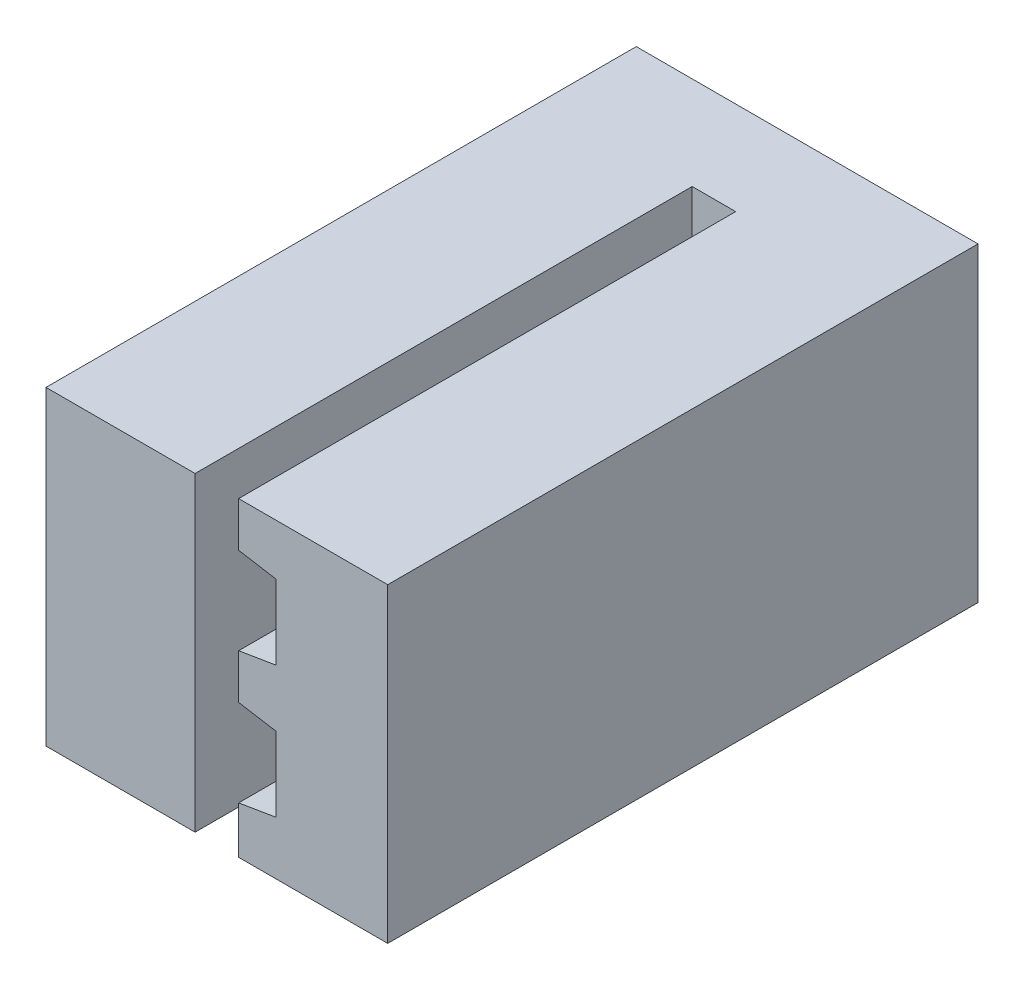
ISO-10303-21;
HEADER;
FILE_DESCRIPTION(('STEP AP214'),'2;1');
FILE_NAME('part.step','',(''),(''),'','','');
FILE_SCHEMA(('AUTOMOTIVE_DESIGN { 1 0 10303 214 1 1 1 1 }'));
ENDSEC;
DATA;
#1=APPLICATION_CONTEXT('core data for automotive mechanical design processes');
#2=APPLICATION_PROTOCOL_DEFINITION('international standard','automotive_design',2000,#1);
#3=PRODUCT_CONTEXT('',#1,'mechanical');
#4=PRODUCT('Part','Part','',(#3));
#5=PRODUCT_RELATED_PRODUCT_CATEGORY('part','',(#4));
#6=PRODUCT_DEFINITION_FORMATION('','',#4);
#7=PRODUCT_DEFINITION_CONTEXT('part definition',#1,'design');
#8=PRODUCT_DEFINITION('design','',#6,#7);
#9=PRODUCT_DEFINITION_SHAPE('','',#8);
#10=(LENGTH_UNIT() NAMED_UNIT(*) SI_UNIT(.MILLI.,.METRE.));
#11=(NAMED_UNIT(*) PLANE_ANGLE_UNIT() SI_UNIT($,.RADIAN.));
#12=(NAMED_UNIT(*) SI_UNIT($,.STERADIAN.) SOLID_ANGLE_UNIT());
#13=UNCERTAINTY_MEASURE_WITH_UNIT(LENGTH_MEASURE(1.E-05),#10,'distance_accuracy_value','');
#14=(GEOMETRIC_REPRESENTATION_CONTEXT(3) GLOBAL_UNCERTAINTY_ASSIGNED_CONTEXT((#13)) GLOBAL_UNIT_ASSIGNED_CONTEXT((#10,
#11,#12)) REPRESENTATION_CONTEXT('',''));
#15=CARTESIAN_POINT('',(0.,0.,0.));
#16=DIRECTION('',(0.,0.,1.));
#17=DIRECTION('',(1.,0.,0.));
#18=AXIS2_PLACEMENT_3D('',#15,#16,#17);
#19=CARTESIAN_POINT('',(0.,0.,0.));
#20=DIRECTION('',(0.,0.,-1.));
#21=DIRECTION('',(-1.,0.,0.));
#22=AXIS2_PLACEMENT_3D('',#19,#20,#21);
#23=PLANE('',#22);
#24=DIRECTION('',(0.,-1.,0.));
#25=VECTOR('',#24,1.);
#26=CARTESIAN_POINT('',(0.,5.,0.));
#27=LINE('',#26,#25);
#28=CARTESIAN_POINT('',(0.,5.,0.));
#29=VERTEX_POINT('',#28);
#30=CARTESIAN_POINT('',(0.,4.27942676809432,0.));
#31=VERTEX_POINT('',#30);
#32=EDGE_CURVE('E136',#29,#31,#27,.T.);
#33=ORIENTED_EDGE('',*,*,#32,.F.);
#34=DIRECTION('',(-1.,0.,0.));
#35=VECTOR('',#34,1.);
#36=CARTESIAN_POINT('',(0.,5.,0.));
#37=LINE('',#36,#35);
#38=CARTESIAN_POINT('',(-0.7,5.,0.));
#39=VERTEX_POINT('',#38);
#40=EDGE_CURVE('E254',#29,#39,#37,.T.);
#41=ORIENTED_EDGE('',*,*,#40,.T.);
#42=DIRECTION('',(0.,1.,0.));
#43=VECTOR('',#42,1.);
#44=CARTESIAN_POINT('',(-0.7,7.15885354,0.));
#45=LINE('',#44,#43);
#46=CARTESIAN_POINT('',(-0.699999999999999,0.,0.));
#47=VERTEX_POINT('',#46);
#48=EDGE_CURVE('E250',#47,#39,#45,.T.);
#49=ORIENTED_EDGE('',*,*,#48,.F.);
#50=DIRECTION('',(-1.,0.,0.));
#51=VECTOR('',#50,1.);
#52=CARTESIAN_POINT('',(2.4,0.,0.));
#53=LINE('',#52,#51);
#54=CARTESIAN_POINT('',(0.,0.,0.));
#55=VERTEX_POINT('',#54);
#56=EDGE_CURVE('E232',#55,#47,#53,.T.);
#57=ORIENTED_EDGE('',*,*,#56,.F.);
#58=DIRECTION('',(0.,-1.,0.));
#59=VECTOR('',#58,1.);
#60=CARTESIAN_POINT('',(0.,0.758853536188495,0.));
#61=LINE('',#60,#59);
#62=CARTESIAN_POINT('',(0.,0.758853536188495,0.));
#63=VERTEX_POINT('',#62);
#64=EDGE_CURVE('E82',#63,#55,#61,.T.);
#65=ORIENTED_EDGE('',*,*,#64,.F.);
#66=DIRECTION('',(-0.986393923832117,-0.164398987305518,0.));
#67=VECTOR('',#66,1.);
#68=CARTESIAN_POINT('',(0.599999999999998,0.858853536188595,0.));
#69=LINE('',#68,#67);
#70=CARTESIAN_POINT('',(0.599999999999998,0.858853536188595,0.));
#71=VERTEX_POINT('',#70);
#72=EDGE_CURVE('E122',#71,#63,#69,.T.);
#73=ORIENTED_EDGE('',*,*,#72,.F.);
#74=DIRECTION('',(0.,-1.,0.));
#75=VECTOR('',#74,1.);
#76=CARTESIAN_POINT('',(0.599999999999998,2.05885353618846,0.));
#77=LINE('',#76,#75);
#78=CARTESIAN_POINT('',(0.599999999999998,2.05885353618846,0.));
#79=VERTEX_POINT('',#78);
#80=EDGE_CURVE('E152',#79,#71,#77,.T.);
#81=ORIENTED_EDGE('',*,*,#80,.F.);
#82=DIRECTION('',(0.986393923832117,-0.164398987305517,0.));
#83=VECTOR('',#82,1.);
#84=CARTESIAN_POINT('',(0.,2.15885353618856,0.));
#85=LINE('',#84,#83);
#86=CARTESIAN_POINT('',(0.,2.15885353618856,0.));
#87=VERTEX_POINT('',#86);
#88=EDGE_CURVE('E149',#87,#79,#85,.T.);
#89=ORIENTED_EDGE('',*,*,#88,.F.);
#90=DIRECTION('',(0.,-1.,0.));
#91=VECTOR('',#90,1.);
#92=CARTESIAN_POINT('',(0.,2.87942676809425,0.));
#93=LINE('',#92,#91);
#94=CARTESIAN_POINT('',(0.,2.87942676809425,0.));
#95=VERTEX_POINT('',#94);
#96=EDGE_CURVE('E146',#95,#87,#93,.T.);
#97=ORIENTED_EDGE('',*,*,#96,.F.);
#98=DIRECTION('',(-0.986393923832117,-0.164398987305518,0.));
#99=VECTOR('',#98,1.);
#100=CARTESIAN_POINT('',(0.599999999999998,2.97942676809435,0.));
#101=LINE('',#100,#99);
#102=CARTESIAN_POINT('',(0.599999999999998,2.97942676809435,0.));
#103=VERTEX_POINT('',#102);
#104=EDGE_CURVE('E143',#103,#95,#101,.T.);
#105=ORIENTED_EDGE('',*,*,#104,.F.);
#106=DIRECTION('',(0.,-1.,0.));
#107=VECTOR('',#106,1.);
#108=CARTESIAN_POINT('',(0.599999999999998,4.17942676809422,0.));
#109=LINE('',#108,#107);
#110=CARTESIAN_POINT('',(0.599999999999998,4.17942676809422,0.));
#111=VERTEX_POINT('',#110);
#112=EDGE_CURVE('E71',#111,#103,#109,.T.);
#113=ORIENTED_EDGE('',*,*,#112,.F.);
#114=DIRECTION('',(0.986393923832117,-0.164398987305519,0.));
#115=VECTOR('',#114,1.);
#116=CARTESIAN_POINT('',(0.,4.27942676809432,0.));
#117=LINE('',#116,#115);
#118=EDGE_CURVE('E139',#31,#111,#117,.T.);
#119=ORIENTED_EDGE('',*,*,#118,.F.);
#120=EDGE_LOOP('',(#33,#41,#49,#57,#65,#73,#81,#89,#97,#105,#113,#119));
#121=FACE_BOUND('',#120,.T.);
#122=ADVANCED_FACE('F32',(#121),#23,.F.);
#123=CARTESIAN_POINT('',(0.,5.,8.));
#124=DIRECTION('',(1.,0.,0.));
#125=DIRECTION('',(0.,1.,0.));
#126=AXIS2_PLACEMENT_3D('',#123,#124,#125);
#127=PLANE('',#126);
#128=ORIENTED_EDGE('',*,*,#32,.T.);
#129=DIRECTION('',(0.,0.,-1.));
#130=VECTOR('',#129,1.);
#131=CARTESIAN_POINT('',(0.,4.27942676809432,8.));
#132=LINE('',#131,#130);
#133=CARTESIAN_POINT('',(0.,4.27942676809432,8.));
#134=VERTEX_POINT('',#133);
#135=EDGE_CURVE('E11',#134,#31,#132,.T.);
#136=ORIENTED_EDGE('',*,*,#135,.F.);
#137=DIRECTION('',(0.,-1.,0.));
#138=VECTOR('',#137,1.);
#139=CARTESIAN_POINT('',(0.,5.,8.));
#140=LINE('',#139,#138);
#141=CARTESIAN_POINT('',(0.,5.,8.));
#142=VERTEX_POINT('',#141);
#143=EDGE_CURVE('E160',#142,#134,#140,.T.);
#144=ORIENTED_EDGE('',*,*,#143,.F.);
#145=DIRECTION('',(0.,0.,-1.));
#146=VECTOR('',#145,1.);
#147=CARTESIAN_POINT('',(0.,5.,8.));
#148=LINE('',#147,#146);
#149=EDGE_CURVE('E135',#142,#29,#148,.T.);
#150=ORIENTED_EDGE('',*,*,#149,.T.);
#151=EDGE_LOOP('',(#128,#136,#144,#150));
#152=FACE_BOUND('',#151,.T.);
#153=ADVANCED_FACE('F34',(#152),#127,.F.);
#154=CARTESIAN_POINT('',(0.,4.27942676809432,8.));
#155=DIRECTION('',(0.164398987305519,0.986393923832117,0.));
#156=DIRECTION('',(-0.986393923832117,0.164398987305519,0.));
#157=AXIS2_PLACEMENT_3D('',#154,#155,#156);
#158=PLANE('',#157);
#159=ORIENTED_EDGE('',*,*,#118,.T.);
#160=DIRECTION('',(0.,0.,-1.));
#161=VECTOR('',#160,1.);
#162=CARTESIAN_POINT('',(0.599999999999998,4.17942676809422,8.));
#163=LINE('',#162,#161);
#164=CARTESIAN_POINT('',(0.599999999999998,4.17942676809422,8.));
#165=VERTEX_POINT('',#164);
#166=EDGE_CURVE('E41',#165,#111,#163,.T.);
#167=ORIENTED_EDGE('',*,*,#166,.F.);
#168=DIRECTION('',(0.986393923832117,-0.164398987305519,0.));
#169=VECTOR('',#168,1.);
#170=CARTESIAN_POINT('',(0.,4.27942676809432,8.));
#171=LINE('',#170,#169);
#172=EDGE_CURVE('E196',#134,#165,#171,.T.);
#173=ORIENTED_EDGE('',*,*,#172,.F.);
#174=ORIENTED_EDGE('',*,*,#135,.T.);
#175=EDGE_LOOP('',(#159,#167,#173,#174));
#176=FACE_BOUND('',#175,.T.);
#177=ADVANCED_FACE('F195',(#176),#158,.F.);
#178=CARTESIAN_POINT('',(0.599999999999998,4.17942676809422,8.));
#179=DIRECTION('',(1.,0.,0.));
#180=DIRECTION('',(0.,1.,0.));
#181=AXIS2_PLACEMENT_3D('',#178,#179,#180);
#182=PLANE('',#181);
#183=ORIENTED_EDGE('',*,*,#112,.T.);
#184=DIRECTION('',(0.,0.,-1.));
#185=VECTOR('',#184,1.);
#186=CARTESIAN_POINT('',(0.599999999999998,2.97942676809435,8.));
#187=LINE('',#186,#185);
#188=CARTESIAN_POINT('',(0.599999999999998,2.97942676809435,8.));
#189=VERTEX_POINT('',#188);
#190=EDGE_CURVE('E184',#189,#103,#187,.T.);
#191=ORIENTED_EDGE('',*,*,#190,.F.);
#192=DIRECTION('',(0.,-1.,0.));
#193=VECTOR('',#192,1.);
#194=CARTESIAN_POINT('',(0.599999999999998,4.17942676809422,8.));
#195=LINE('',#194,#193);
#196=EDGE_CURVE('E193',#165,#189,#195,.T.);
#197=ORIENTED_EDGE('',*,*,#196,.F.);
#198=ORIENTED_EDGE('',*,*,#166,.T.);
#199=EDGE_LOOP('',(#183,#191,#197,#198));
#200=FACE_BOUND('',#199,.T.);
#201=ADVANCED_FACE('F190',(#200),#182,.F.);
#202=CARTESIAN_POINT('',(0.599999999999998,2.97942676809435,8.));
#203=DIRECTION('',(0.164398987305518,-0.986393923832117,0.));
#204=DIRECTION('',(0.986393923832117,0.164398987305518,0.));
#205=AXIS2_PLACEMENT_3D('',#202,#203,#204);
#206=PLANE('',#205);
#207=ORIENTED_EDGE('',*,*,#104,.T.);
#208=DIRECTION('',(0.,0.,-1.));
#209=VECTOR('',#208,1.);
#210=CARTESIAN_POINT('',(0.,2.87942676809425,8.));
#211=LINE('',#210,#209);
#212=CARTESIAN_POINT('',(0.,2.87942676809425,8.));
#213=VERTEX_POINT('',#212);
#214=EDGE_CURVE('E181',#213,#95,#211,.T.);
#215=ORIENTED_EDGE('',*,*,#214,.F.);
#216=DIRECTION('',(-0.986393923832117,-0.164398987305518,0.));
#217=VECTOR('',#216,1.);
#218=CARTESIAN_POINT('',(0.599999999999998,2.97942676809435,8.));
#219=LINE('',#218,#217);
#220=EDGE_CURVE('E227',#189,#213,#219,.T.);
#221=ORIENTED_EDGE('',*,*,#220,.F.);
#222=ORIENTED_EDGE('',*,*,#190,.T.);
#223=EDGE_LOOP('',(#207,#215,#221,#222));
#224=FACE_BOUND('',#223,.T.);
#225=ADVANCED_FACE('F355',(#224),#206,.F.);
#226=CARTESIAN_POINT('',(0.,2.87942676809425,8.));
#227=DIRECTION('',(1.,0.,0.));
#228=DIRECTION('',(0.,1.,0.));
#229=AXIS2_PLACEMENT_3D('',#226,#227,#228);
#230=PLANE('',#229);
#231=ORIENTED_EDGE('',*,*,#96,.T.);
#232=DIRECTION('',(0.,0.,-1.));
#233=VECTOR('',#232,1.);
#234=CARTESIAN_POINT('',(0.,2.15885353618856,8.));
#235=LINE('',#234,#233);
#236=CARTESIAN_POINT('',(0.,2.15885353618856,8.));
#237=VERTEX_POINT('',#236);
#238=EDGE_CURVE('E178',#237,#87,#235,.T.);
#239=ORIENTED_EDGE('',*,*,#238,.F.);
#240=DIRECTION('',(0.,-1.,0.));
#241=VECTOR('',#240,1.);
#242=CARTESIAN_POINT('',(0.,2.87942676809425,8.));
#243=LINE('',#242,#241);
#244=EDGE_CURVE('E223',#213,#237,#243,.T.);
#245=ORIENTED_EDGE('',*,*,#244,.F.);
#246=ORIENTED_EDGE('',*,*,#214,.T.);
#247=EDGE_LOOP('',(#231,#239,#245,#246));
#248=FACE_BOUND('',#247,.T.);
#249=ADVANCED_FACE('F352',(#248),#230,.F.);
#250=CARTESIAN_POINT('',(0.,2.15885353618856,8.));
#251=DIRECTION('',(0.164398987305517,0.986393923832117,0.));
#252=DIRECTION('',(-0.986393923832117,0.164398987305517,0.));
#253=AXIS2_PLACEMENT_3D('',#250,#251,#252);
#254=PLANE('',#253);
#255=ORIENTED_EDGE('',*,*,#88,.T.);
#256=DIRECTION('',(0.,0.,-1.));
#257=VECTOR('',#256,1.);
#258=CARTESIAN_POINT('',(0.599999999999998,2.05885353618846,8.));
#259=LINE('',#258,#257);
#260=CARTESIAN_POINT('',(0.599999999999998,2.05885353618846,8.));
#261=VERTEX_POINT('',#260);
#262=EDGE_CURVE('E175',#261,#79,#259,.T.);
#263=ORIENTED_EDGE('',*,*,#262,.F.);
#264=DIRECTION('',(0.986393923832117,-0.164398987305517,0.));
#265=VECTOR('',#264,1.);
#266=CARTESIAN_POINT('',(0.,2.15885353618856,8.));
#267=LINE('',#266,#265);
#268=EDGE_CURVE('E222',#237,#261,#267,.T.);
#269=ORIENTED_EDGE('',*,*,#268,.F.);
#270=ORIENTED_EDGE('',*,*,#238,.T.);
#271=EDGE_LOOP('',(#255,#263,#269,#270));
#272=FACE_BOUND('',#271,.T.);
#273=ADVANCED_FACE('F218',(#272),#254,.F.);
#274=CARTESIAN_POINT('',(0.599999999999998,2.05885353618846,8.));
#275=DIRECTION('',(1.,0.,0.));
#276=DIRECTION('',(0.,0.,-1.));
#277=AXIS2_PLACEMENT_3D('',#274,#275,#276);
#278=PLANE('',#277);
#279=ORIENTED_EDGE('',*,*,#80,.T.);
#280=DIRECTION('',(0.,0.,-1.));
#281=VECTOR('',#280,1.);
#282=CARTESIAN_POINT('',(0.599999999999998,0.858853536188595,8.));
#283=LINE('',#282,#281);
#284=CARTESIAN_POINT('',(0.599999999999998,0.858853536188595,8.));
#285=VERTEX_POINT('',#284);
#286=EDGE_CURVE('E124',#285,#71,#283,.T.);
#287=ORIENTED_EDGE('',*,*,#286,.F.);
#288=DIRECTION('',(0.,-1.,0.));
#289=VECTOR('',#288,1.);
#290=CARTESIAN_POINT('',(0.599999999999998,2.05885353618846,8.));
#291=LINE('',#290,#289);
#292=EDGE_CURVE('E114',#261,#285,#291,.T.);
#293=ORIENTED_EDGE('',*,*,#292,.F.);
#294=ORIENTED_EDGE('',*,*,#262,.T.);
#295=EDGE_LOOP('',(#279,#287,#293,#294));
#296=FACE_BOUND('',#295,.T.);
#297=ADVANCED_FACE('F221',(#296),#278,.F.);
#298=CARTESIAN_POINT('',(0.599999999999998,0.858853536188595,8.));
#299=DIRECTION('',(0.164398987305518,-0.986393923832117,0.));
#300=DIRECTION('',(0.986393923832117,0.164398987305518,0.));
#301=AXIS2_PLACEMENT_3D('',#298,#299,#300);
#302=PLANE('',#301);
#303=ORIENTED_EDGE('',*,*,#72,.T.);
#304=DIRECTION('',(0.,0.,-1.));
#305=VECTOR('',#304,1.);
#306=CARTESIAN_POINT('',(0.,0.758853536188495,8.));
#307=LINE('',#306,#305);
#308=CARTESIAN_POINT('',(0.,0.758853536188495,8.));
#309=VERTEX_POINT('',#308);
#310=EDGE_CURVE('E120',#309,#63,#307,.T.);
#311=ORIENTED_EDGE('',*,*,#310,.F.);
#312=DIRECTION('',(-0.986393923832117,-0.164398987305518,0.));
#313=VECTOR('',#312,1.);
#314=CARTESIAN_POINT('',(0.599999999999998,0.858853536188595,8.));
#315=LINE('',#314,#313);
#316=EDGE_CURVE('E106',#285,#309,#315,.T.);
#317=ORIENTED_EDGE('',*,*,#316,.F.);
#318=ORIENTED_EDGE('',*,*,#286,.T.);
#319=EDGE_LOOP('',(#303,#311,#317,#318));
#320=FACE_BOUND('',#319,.T.);
#321=ADVANCED_FACE('F121',(#320),#302,.F.);
#322=CARTESIAN_POINT('',(0.,0.758853536188495,8.));
#323=DIRECTION('',(1.,0.,0.));
#324=DIRECTION('',(0.,1.,0.));
#325=AXIS2_PLACEMENT_3D('',#322,#323,#324);
#326=PLANE('',#325);
#327=ORIENTED_EDGE('',*,*,#64,.T.);
#328=DIRECTION('',(0.,0.,-1.));
#329=VECTOR('',#328,1.);
#330=CARTESIAN_POINT('',(0.,0.,8.));
#331=LINE('',#330,#329);
#332=CARTESIAN_POINT('',(0.,0.,8.));
#333=VERTEX_POINT('',#332);
#334=EDGE_CURVE('E125',#333,#55,#331,.T.);
#335=ORIENTED_EDGE('',*,*,#334,.F.);
#336=DIRECTION('',(0.,-1.,0.));
#337=VECTOR('',#336,1.);
#338=CARTESIAN_POINT('',(0.,0.758853536188495,8.));
#339=LINE('',#338,#337);
#340=EDGE_CURVE('E111',#309,#333,#339,.T.);
#341=ORIENTED_EDGE('',*,*,#340,.F.);
#342=ORIENTED_EDGE('',*,*,#310,.T.);
#343=EDGE_LOOP('',(#327,#335,#341,#342));
#344=FACE_BOUND('',#343,.T.);
#345=ADVANCED_FACE('F127',(#344),#326,.F.);
#346=CARTESIAN_POINT('',(0.,0.,8.));
#347=DIRECTION('',(0.,1.,0.));
#348=DIRECTION('',(0.,0.,1.));
#349=AXIS2_PLACEMENT_3D('',#346,#347,#348);
#350=PLANE('',#349);
#351=ORIENTED_EDGE('',*,*,#334,.T.);
#352=ORIENTED_EDGE('',*,*,#56,.T.);
#353=DIRECTION('',(0.,0.,-1.));
#354=VECTOR('',#353,1.);
#355=CARTESIAN_POINT('',(-0.699999999999999,0.,8.));
#356=LINE('',#355,#354);
#357=CARTESIAN_POINT('',(-0.699999999999999,0.,8.));
#358=VERTEX_POINT('',#357);
#359=EDGE_CURVE('E236',#358,#47,#356,.T.);
#360=ORIENTED_EDGE('',*,*,#359,.F.);
#361=DIRECTION('',(1.,0.,0.));
#362=VECTOR('',#361,1.);
#363=CARTESIAN_POINT('',(-0.699999999999999,0.,8.));
#364=LINE('',#363,#362);
#365=CARTESIAN_POINT('',(-3.1,0.,8.));
#366=VERTEX_POINT('',#365);
#367=EDGE_CURVE('E249',#366,#358,#364,.T.);
#368=ORIENTED_EDGE('',*,*,#367,.F.);
#369=DIRECTION('',(0.,0.,1.));
#370=VECTOR('',#369,1.);
#371=CARTESIAN_POINT('',(-3.1,0.,-1.5));
#372=LINE('',#371,#370);
#373=CARTESIAN_POINT('',(-3.1,0.,-1.5));
#374=VERTEX_POINT('',#373);
#375=EDGE_CURVE('E140',#374,#366,#372,.T.);
#376=ORIENTED_EDGE('',*,*,#375,.F.);
#377=DIRECTION('',(-1.,0.,0.));
#378=VECTOR('',#377,1.);
#379=CARTESIAN_POINT('',(2.4,0.,-1.5));
#380=LINE('',#379,#378);
#381=CARTESIAN_POINT('',(2.4,0.,-1.5));
#382=VERTEX_POINT('',#381);
#383=EDGE_CURVE('E242',#382,#374,#380,.T.);
#384=ORIENTED_EDGE('',*,*,#383,.F.);
#385=DIRECTION('',(0.,0.,-1.));
#386=VECTOR('',#385,1.);
#387=CARTESIAN_POINT('',(2.4,0.,8.));
#388=LINE('',#387,#386);
#389=CARTESIAN_POINT('',(2.4,0.,8.));
#390=VERTEX_POINT('',#389);
#391=EDGE_CURVE('E162',#390,#382,#388,.T.);
#392=ORIENTED_EDGE('',*,*,#391,.F.);
#393=DIRECTION('',(1.,0.,0.));
#394=VECTOR('',#393,1.);
#395=CARTESIAN_POINT('',(0.,0.,8.));
#396=LINE('',#395,#394);
#397=EDGE_CURVE('E58',#333,#390,#396,.T.);
#398=ORIENTED_EDGE('',*,*,#397,.F.);
#399=EDGE_LOOP('',(#351,#352,#360,#368,#376,#384,#392,#398));
#400=FACE_BOUND('',#399,.T.);
#401=ADVANCED_FACE('F308',(#400),#350,.F.);
#402=CARTESIAN_POINT('',(2.4,0.,8.));
#403=DIRECTION('',(-1.,0.,0.));
#404=DIRECTION('',(0.,0.,1.));
#405=AXIS2_PLACEMENT_3D('',#402,#403,#404);
#406=PLANE('',#405);
#407=DIRECTION('',(0.,-1.,0.));
#408=VECTOR('',#407,1.);
#409=CARTESIAN_POINT('',(2.4,7.15885354,-1.5));
#410=LINE('',#409,#408);
#411=CARTESIAN_POINT('',(2.4,5.,-1.5));
#412=VERTEX_POINT('',#411);
#413=EDGE_CURVE('E235',#412,#382,#410,.T.);
#414=ORIENTED_EDGE('',*,*,#413,.F.);
#415=DIRECTION('',(0.,0.,1.));
#416=VECTOR('',#415,1.);
#417=CARTESIAN_POINT('',(2.4,5.,-1.5));
#418=LINE('',#417,#416);
#419=CARTESIAN_POINT('',(2.4,5.,8.));
#420=VERTEX_POINT('',#419);
#421=EDGE_CURVE('E266',#412,#420,#418,.T.);
#422=ORIENTED_EDGE('',*,*,#421,.T.);
#423=DIRECTION('',(0.,1.,0.));
#424=VECTOR('',#423,1.);
#425=CARTESIAN_POINT('',(2.4,0.,8.));
#426=LINE('',#425,#424);
#427=EDGE_CURVE('E130',#390,#420,#426,.T.);
#428=ORIENTED_EDGE('',*,*,#427,.F.);
#429=ORIENTED_EDGE('',*,*,#391,.T.);
#430=EDGE_LOOP('',(#414,#422,#428,#429));
#431=FACE_BOUND('',#430,.T.);
#432=ADVANCED_FACE('F283',(#431),#406,.F.);
#433=CARTESIAN_POINT('',(0.,0.,8.));
#434=DIRECTION('',(0.,0.,1.));
#435=DIRECTION('',(1.,0.,0.));
#436=AXIS2_PLACEMENT_3D('',#433,#434,#435);
#437=PLANE('',#436);
#438=DIRECTION('',(1.,0.,0.));
#439=VECTOR('',#438,1.);
#440=CARTESIAN_POINT('',(-3.1,5.,8.));
#441=LINE('',#440,#439);
#442=EDGE_CURVE('E273',#142,#420,#441,.T.);
#443=ORIENTED_EDGE('',*,*,#442,.F.);
#444=ORIENTED_EDGE('',*,*,#143,.T.);
#445=ORIENTED_EDGE('',*,*,#172,.T.);
#446=ORIENTED_EDGE('',*,*,#196,.T.);
#447=ORIENTED_EDGE('',*,*,#220,.T.);
#448=ORIENTED_EDGE('',*,*,#244,.T.);
#449=ORIENTED_EDGE('',*,*,#268,.T.);
#450=ORIENTED_EDGE('',*,*,#292,.T.);
#451=ORIENTED_EDGE('',*,*,#316,.T.);
#452=ORIENTED_EDGE('',*,*,#340,.T.);
#453=ORIENTED_EDGE('',*,*,#397,.T.);
#454=ORIENTED_EDGE('',*,*,#427,.T.);
#455=EDGE_LOOP('',(#443,#444,#445,#446,#447,#448,#449,#450,#451,#452,#453,#454));
#456=FACE_BOUND('',#455,.T.);
#457=ADVANCED_FACE('F109',(#456),#437,.T.);
#458=CARTESIAN_POINT('',(-3.1,7.15885354,-1.5));
#459=DIRECTION('',(1.,0.,0.));
#460=DIRECTION('',(0.,1.,0.));
#461=AXIS2_PLACEMENT_3D('',#458,#459,#460);
#462=PLANE('',#461);
#463=DIRECTION('',(0.,-1.,0.));
#464=VECTOR('',#463,1.);
#465=CARTESIAN_POINT('',(-3.1,7.15885354,8.));
#466=LINE('',#465,#464);
#467=CARTESIAN_POINT('',(-3.1,5.,8.));
#468=VERTEX_POINT('',#467);
#469=EDGE_CURVE('E257',#468,#366,#466,.T.);
#470=ORIENTED_EDGE('',*,*,#469,.F.);
#471=DIRECTION('',(0.,0.,1.));
#472=VECTOR('',#471,1.);
#473=CARTESIAN_POINT('',(-3.1,5.,-1.5));
#474=LINE('',#473,#472);
#475=CARTESIAN_POINT('',(-3.1,5.,-1.5));
#476=VERTEX_POINT('',#475);
#477=EDGE_CURVE('E49',#476,#468,#474,.T.);
#478=ORIENTED_EDGE('',*,*,#477,.F.);
#479=DIRECTION('',(0.,1.,0.));
#480=VECTOR('',#479,1.);
#481=CARTESIAN_POINT('',(-3.1,7.15885354,-1.5));
#482=LINE('',#481,#480);
#483=EDGE_CURVE('E239',#374,#476,#482,.T.);
#484=ORIENTED_EDGE('',*,*,#483,.F.);
#485=ORIENTED_EDGE('',*,*,#375,.T.);
#486=EDGE_LOOP('',(#470,#478,#484,#485));
#487=FACE_BOUND('',#486,.T.);
#488=ADVANCED_FACE('F317',(#487),#462,.F.);
#489=CARTESIAN_POINT('',(0.,0.,-1.5));
#490=DIRECTION('',(0.,0.,-1.));
#491=DIRECTION('',(-1.,0.,0.));
#492=AXIS2_PLACEMENT_3D('',#489,#490,#491);
#493=PLANE('',#492);
#494=DIRECTION('',(1.,0.,0.));
#495=VECTOR('',#494,1.);
#496=CARTESIAN_POINT('',(-3.1,5.,-1.5));
#497=LINE('',#496,#495);
#498=EDGE_CURVE('E268',#476,#412,#497,.T.);
#499=ORIENTED_EDGE('',*,*,#498,.T.);
#500=ORIENTED_EDGE('',*,*,#413,.T.);
#501=ORIENTED_EDGE('',*,*,#383,.T.);
#502=ORIENTED_EDGE('',*,*,#483,.T.);
#503=EDGE_LOOP('',(#499,#500,#501,#502));
#504=FACE_BOUND('',#503,.T.);
#505=ADVANCED_FACE('F277',(#504),#493,.T.);
#506=CARTESIAN_POINT('',(-0.7,7.15885354,8.));
#507=DIRECTION('',(-1.,0.,0.));
#508=DIRECTION('',(0.,-1.,0.));
#509=AXIS2_PLACEMENT_3D('',#506,#507,#508);
#510=PLANE('',#509);
#511=ORIENTED_EDGE('',*,*,#48,.T.);
#512=DIRECTION('',(0.,0.,1.));
#513=VECTOR('',#512,1.);
#514=CARTESIAN_POINT('',(-0.7,5.,8.));
#515=LINE('',#514,#513);
#516=CARTESIAN_POINT('',(-0.699999999999999,5.,8.));
#517=VERTEX_POINT('',#516);
#518=EDGE_CURVE('E263',#39,#517,#515,.T.);
#519=ORIENTED_EDGE('',*,*,#518,.T.);
#520=DIRECTION('',(0.,1.,0.));
#521=VECTOR('',#520,1.);
#522=CARTESIAN_POINT('',(-0.7,7.15885354,8.));
#523=LINE('',#522,#521);
#524=EDGE_CURVE('E253',#358,#517,#523,.T.);
#525=ORIENTED_EDGE('',*,*,#524,.F.);
#526=ORIENTED_EDGE('',*,*,#359,.T.);
#527=EDGE_LOOP('',(#511,#519,#525,#526));
#528=FACE_BOUND('',#527,.T.);
#529=ADVANCED_FACE('F301',(#528),#510,.F.);
#530=CARTESIAN_POINT('',(0.,0.,8.));
#531=DIRECTION('',(0.,0.,-1.));
#532=DIRECTION('',(-1.,0.,0.));
#533=AXIS2_PLACEMENT_3D('',#530,#531,#532);
#534=PLANE('',#533);
#535=ORIENTED_EDGE('',*,*,#524,.T.);
#536=EDGE_CURVE('E271',#468,#517,#441,.T.);
#537=ORIENTED_EDGE('',*,*,#536,.F.);
#538=ORIENTED_EDGE('',*,*,#469,.T.);
#539=ORIENTED_EDGE('',*,*,#367,.T.);
#540=EDGE_LOOP('',(#535,#537,#538,#539));
#541=FACE_BOUND('',#540,.T.);
#542=ADVANCED_FACE('F320',(#541),#534,.F.);
#543=CARTESIAN_POINT('',(-3.1,5.,-1.5));
#544=DIRECTION('',(0.,-1.,0.));
#545=DIRECTION('',(0.,0.,-1.));
#546=AXIS2_PLACEMENT_3D('',#543,#544,#545);
#547=PLANE('',#546);
#548=ORIENTED_EDGE('',*,*,#442,.T.);
#549=ORIENTED_EDGE('',*,*,#421,.F.);
#550=ORIENTED_EDGE('',*,*,#498,.F.);
#551=ORIENTED_EDGE('',*,*,#477,.T.);
#552=ORIENTED_EDGE('',*,*,#536,.T.);
#553=ORIENTED_EDGE('',*,*,#518,.F.);
#554=ORIENTED_EDGE('',*,*,#40,.F.);
#555=ORIENTED_EDGE('',*,*,#149,.F.);
#556=EDGE_LOOP('',(#548,#549,#550,#551,#552,#553,#554,#555));
#557=FACE_BOUND('',#556,.T.);
#558=ADVANCED_FACE('F296',(#557),#547,.F.);
#559=CLOSED_SHELL('',(#122,#153,#177,#201,#225,#249,#273,#297,#321,#345,#401,#432,#457,#488,
#505,#529,#542,#558));
#560=MANIFOLD_SOLID_BREP('B2',#559);
#561=ADVANCED_BREP_SHAPE_REPRESENTATION('',(#18,#560),#14);
#562=SHAPE_DEFINITION_REPRESENTATION(#9,#561);
ENDSEC;
END-ISO-10303-21;
